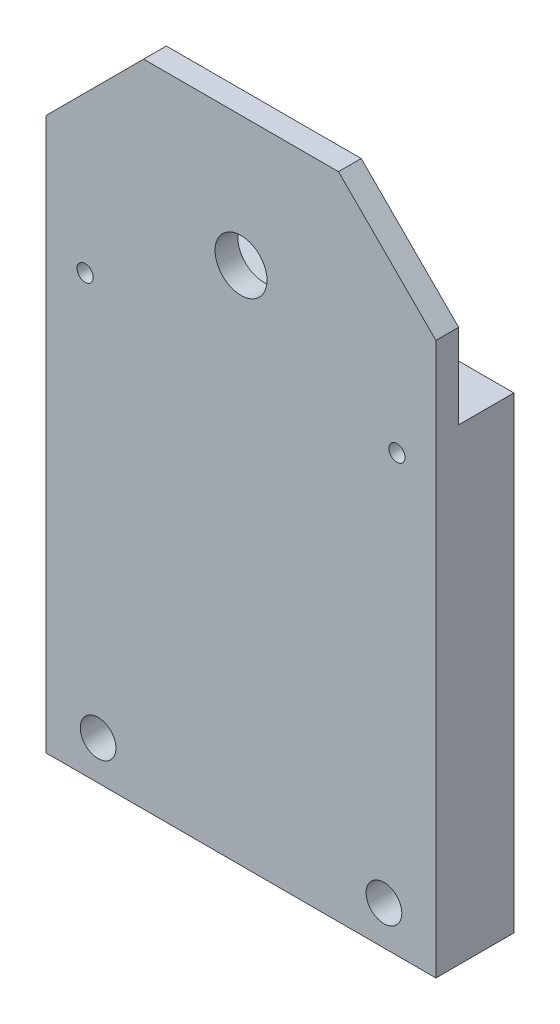
ISO-10303-21;
HEADER;
FILE_DESCRIPTION(('STEP AP214'),'2;1');
FILE_NAME('part.step','',(''),(''),'','','');
FILE_SCHEMA(('AUTOMOTIVE_DESIGN { 1 0 10303 214 1 1 1 1 }'));
ENDSEC;
DATA;
#1=APPLICATION_CONTEXT('core data for automotive mechanical design processes');
#2=APPLICATION_PROTOCOL_DEFINITION('international standard','automotive_design',2000,#1);
#3=PRODUCT_CONTEXT('',#1,'mechanical');
#4=PRODUCT('Part','Part','',(#3));
#5=PRODUCT_RELATED_PRODUCT_CATEGORY('part','',(#4));
#6=PRODUCT_DEFINITION_FORMATION('','',#4);
#7=PRODUCT_DEFINITION_CONTEXT('part definition',#1,'design');
#8=PRODUCT_DEFINITION('design','',#6,#7);
#9=PRODUCT_DEFINITION_SHAPE('','',#8);
#10=(LENGTH_UNIT() NAMED_UNIT(*) SI_UNIT(.MILLI.,.METRE.));
#11=(NAMED_UNIT(*) PLANE_ANGLE_UNIT() SI_UNIT($,.RADIAN.));
#12=(NAMED_UNIT(*) SI_UNIT($,.STERADIAN.) SOLID_ANGLE_UNIT());
#13=UNCERTAINTY_MEASURE_WITH_UNIT(LENGTH_MEASURE(1.E-05),#10,'distance_accuracy_value','');
#14=(GEOMETRIC_REPRESENTATION_CONTEXT(3) GLOBAL_UNCERTAINTY_ASSIGNED_CONTEXT((#13)) GLOBAL_UNIT_ASSIGNED_CONTEXT((#10,
#11,#12)) REPRESENTATION_CONTEXT('',''));
#15=CARTESIAN_POINT('',(0.,0.,0.));
#16=DIRECTION('',(0.,0.,1.));
#17=DIRECTION('',(1.,0.,0.));
#18=AXIS2_PLACEMENT_3D('',#15,#16,#17);
#19=CARTESIAN_POINT('',(0.,0.,12.));
#20=DIRECTION('',(1.,0.,0.));
#21=DIRECTION('',(0.,0.,-1.));
#22=AXIS2_PLACEMENT_3D('',#19,#20,#21);
#23=PLANE('',#22);
#24=DIRECTION('',(0.,-1.,0.));
#25=VECTOR('',#24,1.);
#26=CARTESIAN_POINT('',(0.,0.,12.));
#27=LINE('',#26,#25);
#28=CARTESIAN_POINT('',(0.,85.,12.));
#29=VERTEX_POINT('',#28);
#30=CARTESIAN_POINT('',(0.,0.,12.));
#31=VERTEX_POINT('',#30);
#32=EDGE_CURVE('E142',#29,#31,#27,.T.);
#33=ORIENTED_EDGE('',*,*,#32,.F.);
#34=DIRECTION('',(0.,0.,-1.));
#35=VECTOR('',#34,1.);
#36=CARTESIAN_POINT('',(0.,85.,12.));
#37=LINE('',#36,#35);
#38=CARTESIAN_POINT('',(0.,85.,8.50000000000001));
#39=VERTEX_POINT('',#38);
#40=EDGE_CURVE('E159',#29,#39,#37,.T.);
#41=ORIENTED_EDGE('',*,*,#40,.T.);
#42=DIRECTION('',(0.,1.,0.));
#43=VECTOR('',#42,1.);
#44=CARTESIAN_POINT('',(0.,100.,8.5));
#45=LINE('',#44,#43);
#46=CARTESIAN_POINT('',(0.,72.,8.50000000000001));
#47=VERTEX_POINT('',#46);
#48=EDGE_CURVE('E125',#47,#39,#45,.T.);
#49=ORIENTED_EDGE('',*,*,#48,.F.);
#50=DIRECTION('',(0.,0.,1.));
#51=VECTOR('',#50,1.);
#52=CARTESIAN_POINT('',(0.,72.,0.));
#53=LINE('',#52,#51);
#54=CARTESIAN_POINT('',(0.,72.,0.));
#55=VERTEX_POINT('',#54);
#56=EDGE_CURVE('E107',#55,#47,#53,.T.);
#57=ORIENTED_EDGE('',*,*,#56,.F.);
#58=DIRECTION('',(0.,-1.,0.));
#59=VECTOR('',#58,1.);
#60=CARTESIAN_POINT('',(0.,0.,0.));
#61=LINE('',#60,#59);
#62=CARTESIAN_POINT('',(0.,0.,0.));
#63=VERTEX_POINT('',#62);
#64=EDGE_CURVE('E141',#55,#63,#61,.T.);
#65=ORIENTED_EDGE('',*,*,#64,.T.);
#66=DIRECTION('',(0.,0.,-1.));
#67=VECTOR('',#66,1.);
#68=CARTESIAN_POINT('',(0.,0.,12.));
#69=LINE('',#68,#67);
#70=EDGE_CURVE('E156',#31,#63,#69,.T.);
#71=ORIENTED_EDGE('',*,*,#70,.F.);
#72=EDGE_LOOP('',(#33,#41,#49,#57,#65,#71));
#73=FACE_BOUND('',#72,.T.);
#74=ADVANCED_FACE('F34',(#73),#23,.F.);
#75=CARTESIAN_POINT('',(0.,0.,12.));
#76=DIRECTION('',(0.,1.,0.));
#77=DIRECTION('',(0.,0.,1.));
#78=AXIS2_PLACEMENT_3D('',#75,#76,#77);
#79=PLANE('',#78);
#80=DIRECTION('',(1.,0.,0.));
#81=VECTOR('',#80,1.);
#82=CARTESIAN_POINT('',(0.,0.,0.));
#83=LINE('',#82,#81);
#84=CARTESIAN_POINT('',(60.,0.,0.));
#85=VERTEX_POINT('',#84);
#86=EDGE_CURVE('E152',#63,#85,#83,.T.);
#87=ORIENTED_EDGE('',*,*,#86,.T.);
#88=DIRECTION('',(0.,0.,-1.));
#89=VECTOR('',#88,1.);
#90=CARTESIAN_POINT('',(60.,0.,12.));
#91=LINE('',#90,#89);
#92=CARTESIAN_POINT('',(60.,0.,12.));
#93=VERTEX_POINT('',#92);
#94=EDGE_CURVE('E150',#93,#85,#91,.T.);
#95=ORIENTED_EDGE('',*,*,#94,.F.);
#96=DIRECTION('',(1.,0.,0.));
#97=VECTOR('',#96,1.);
#98=CARTESIAN_POINT('',(0.,0.,12.));
#99=LINE('',#98,#97);
#100=EDGE_CURVE('E144',#31,#93,#99,.T.);
#101=ORIENTED_EDGE('',*,*,#100,.F.);
#102=ORIENTED_EDGE('',*,*,#70,.T.);
#103=EDGE_LOOP('',(#87,#95,#101,#102));
#104=FACE_BOUND('',#103,.T.);
#105=ADVANCED_FACE('F190',(#104),#79,.F.);
#106=CARTESIAN_POINT('',(60.,0.,12.));
#107=DIRECTION('',(-1.,0.,0.));
#108=DIRECTION('',(0.,0.,1.));
#109=AXIS2_PLACEMENT_3D('',#106,#107,#108);
#110=PLANE('',#109);
#111=DIRECTION('',(0.,1.,0.));
#112=VECTOR('',#111,1.);
#113=CARTESIAN_POINT('',(60.,100.,8.5));
#114=LINE('',#113,#112);
#115=CARTESIAN_POINT('',(60.,72.,8.50000000000001));
#116=VERTEX_POINT('',#115);
#117=CARTESIAN_POINT('',(60.,84.9999999999999,8.50000000000001));
#118=VERTEX_POINT('',#117);
#119=EDGE_CURVE('E114',#116,#118,#114,.T.);
#120=ORIENTED_EDGE('',*,*,#119,.T.);
#121=DIRECTION('',(0.,0.,1.));
#122=VECTOR('',#121,1.);
#123=CARTESIAN_POINT('',(60.,84.9999999999999,12.));
#124=LINE('',#123,#122);
#125=CARTESIAN_POINT('',(60.,84.9999999999999,12.));
#126=VERTEX_POINT('',#125);
#127=EDGE_CURVE('E11',#118,#126,#124,.T.);
#128=ORIENTED_EDGE('',*,*,#127,.T.);
#129=DIRECTION('',(0.,1.,0.));
#130=VECTOR('',#129,1.);
#131=CARTESIAN_POINT('',(60.,0.,12.));
#132=LINE('',#131,#130);
#133=EDGE_CURVE('E146',#93,#126,#132,.T.);
#134=ORIENTED_EDGE('',*,*,#133,.F.);
#135=ORIENTED_EDGE('',*,*,#94,.T.);
#136=DIRECTION('',(0.,1.,0.));
#137=VECTOR('',#136,1.);
#138=CARTESIAN_POINT('',(60.,0.,0.));
#139=LINE('',#138,#137);
#140=CARTESIAN_POINT('',(60.,72.,0.));
#141=VERTEX_POINT('',#140);
#142=EDGE_CURVE('E124',#85,#141,#139,.T.);
#143=ORIENTED_EDGE('',*,*,#142,.T.);
#144=DIRECTION('',(0.,0.,1.));
#145=VECTOR('',#144,1.);
#146=CARTESIAN_POINT('',(60.,72.,0.));
#147=LINE('',#146,#145);
#148=EDGE_CURVE('E104',#141,#116,#147,.T.);
#149=ORIENTED_EDGE('',*,*,#148,.T.);
#150=EDGE_LOOP('',(#120,#128,#134,#135,#143,#149));
#151=FACE_BOUND('',#150,.T.);
#152=ADVANCED_FACE('F121',(#151),#110,.F.);
#153=CARTESIAN_POINT('',(0.,100.,12.));
#154=DIRECTION('',(0.,-1.,0.));
#155=DIRECTION('',(0.,0.,-1.));
#156=AXIS2_PLACEMENT_3D('',#153,#154,#155);
#157=PLANE('',#156);
#158=DIRECTION('',(-1.,0.,0.));
#159=VECTOR('',#158,1.);
#160=CARTESIAN_POINT('',(60.,100.,8.5));
#161=LINE('',#160,#159);
#162=CARTESIAN_POINT('',(45.,100.,8.5));
#163=VERTEX_POINT('',#162);
#164=CARTESIAN_POINT('',(15.0000000000001,100.,8.5));
#165=VERTEX_POINT('',#164);
#166=EDGE_CURVE('E111',#163,#165,#161,.T.);
#167=ORIENTED_EDGE('',*,*,#166,.T.);
#168=DIRECTION('',(0.,0.,1.));
#169=VECTOR('',#168,1.);
#170=CARTESIAN_POINT('',(15.0000000000001,100.,12.));
#171=LINE('',#170,#169);
#172=CARTESIAN_POINT('',(15.0000000000001,100.,12.));
#173=VERTEX_POINT('',#172);
#174=EDGE_CURVE('E55',#165,#173,#171,.T.);
#175=ORIENTED_EDGE('',*,*,#174,.T.);
#176=DIRECTION('',(-1.,0.,0.));
#177=VECTOR('',#176,1.);
#178=CARTESIAN_POINT('',(0.,100.,12.));
#179=LINE('',#178,#177);
#180=CARTESIAN_POINT('',(45.,100.,12.));
#181=VERTEX_POINT('',#180);
#182=EDGE_CURVE('E148',#181,#173,#179,.T.);
#183=ORIENTED_EDGE('',*,*,#182,.F.);
#184=DIRECTION('',(0.,0.,-1.));
#185=VECTOR('',#184,1.);
#186=CARTESIAN_POINT('',(45.,100.,12.));
#187=LINE('',#186,#185);
#188=EDGE_CURVE('E165',#181,#163,#187,.T.);
#189=ORIENTED_EDGE('',*,*,#188,.T.);
#190=EDGE_LOOP('',(#167,#175,#183,#189));
#191=FACE_BOUND('',#190,.T.);
#192=ADVANCED_FACE('F180',(#191),#157,.F.);
#193=CARTESIAN_POINT('',(0.,100.,12.));
#194=DIRECTION('',(0.,0.,-1.));
#195=DIRECTION('',(-1.,0.,0.));
#196=AXIS2_PLACEMENT_3D('',#193,#194,#195);
#197=PLANE('',#196);
#198=CARTESIAN_POINT('',(52.,6.,12.));
#199=DIRECTION('',(0.,0.,-1.));
#200=DIRECTION('',(-1.,0.,0.));
#201=AXIS2_PLACEMENT_3D('',#198,#199,#200);
#202=CIRCLE('',#201,2.75);
#203=CARTESIAN_POINT('',(49.25,6.,12.));
#204=VERTEX_POINT('',#203);
#205=EDGE_CURVE('E396',#204,#204,#202,.T.);
#206=ORIENTED_EDGE('',*,*,#205,.T.);
#207=EDGE_LOOP('',(#206));
#208=FACE_BOUND('',#207,.T.);
#209=CARTESIAN_POINT('',(8.,6.,12.));
#210=DIRECTION('',(0.,0.,-1.));
#211=DIRECTION('',(-1.,0.,0.));
#212=AXIS2_PLACEMENT_3D('',#209,#210,#211);
#213=CIRCLE('',#212,2.75);
#214=CARTESIAN_POINT('',(5.25,6.,12.));
#215=VERTEX_POINT('',#214);
#216=EDGE_CURVE('E386',#215,#215,#213,.T.);
#217=ORIENTED_EDGE('',*,*,#216,.T.);
#218=EDGE_LOOP('',(#217));
#219=FACE_BOUND('',#218,.T.);
#220=CARTESIAN_POINT('',(6.00000000000001,67.,12.));
#221=DIRECTION('',(0.,0.,1.));
#222=DIRECTION('',(1.,0.,0.));
#223=AXIS2_PLACEMENT_3D('',#220,#221,#222);
#224=CIRCLE('',#223,1.24999999999999);
#225=CARTESIAN_POINT('',(7.24999999999999,67.,12.));
#226=VERTEX_POINT('',#225);
#227=EDGE_CURVE('E381',#226,#226,#224,.T.);
#228=ORIENTED_EDGE('',*,*,#227,.F.);
#229=EDGE_LOOP('',(#228));
#230=FACE_BOUND('',#229,.T.);
#231=CARTESIAN_POINT('',(54.,67.,12.));
#232=DIRECTION('',(0.,0.,1.));
#233=DIRECTION('',(1.,0.,0.));
#234=AXIS2_PLACEMENT_3D('',#231,#232,#233);
#235=CIRCLE('',#234,1.24999999999999);
#236=CARTESIAN_POINT('',(55.25,67.,12.));
#237=VERTEX_POINT('',#236);
#238=EDGE_CURVE('E377',#237,#237,#235,.T.);
#239=ORIENTED_EDGE('',*,*,#238,.F.);
#240=EDGE_LOOP('',(#239));
#241=FACE_BOUND('',#240,.T.);
#242=CARTESIAN_POINT('',(30.,80.,12.));
#243=DIRECTION('',(0.,0.,1.));
#244=DIRECTION('',(1.,0.,0.));
#245=AXIS2_PLACEMENT_3D('',#242,#243,#244);
#246=CIRCLE('',#245,4.);
#247=CARTESIAN_POINT('',(34.,80.,12.));
#248=VERTEX_POINT('',#247);
#249=EDGE_CURVE('E138',#248,#248,#246,.T.);
#250=ORIENTED_EDGE('',*,*,#249,.F.);
#251=EDGE_LOOP('',(#250));
#252=FACE_BOUND('',#251,.T.);
#253=ORIENTED_EDGE('',*,*,#182,.T.);
#254=DIRECTION('',(0.707106781186549,0.707106781186547,0.));
#255=VECTOR('',#254,1.);
#256=CARTESIAN_POINT('',(0.,85.,12.));
#257=LINE('',#256,#255);
#258=EDGE_CURVE('E42',#173,#29,#257,.F.);
#259=ORIENTED_EDGE('',*,*,#258,.T.);
#260=ORIENTED_EDGE('',*,*,#32,.T.);
#261=ORIENTED_EDGE('',*,*,#100,.T.);
#262=ORIENTED_EDGE('',*,*,#133,.T.);
#263=DIRECTION('',(0.707106781186546,-0.707106781186549,0.));
#264=VECTOR('',#263,1.);
#265=CARTESIAN_POINT('',(45.,100.,12.));
#266=LINE('',#265,#264);
#267=EDGE_CURVE('E169',#126,#181,#266,.F.);
#268=ORIENTED_EDGE('',*,*,#267,.T.);
#269=EDGE_LOOP('',(#253,#259,#260,#261,#262,#268));
#270=FACE_BOUND('',#269,.T.);
#271=ADVANCED_FACE('F173',(#208,#219,#230,#241,#252,#270),#197,.F.);
#272=CARTESIAN_POINT('',(0.,100.,0.));
#273=DIRECTION('',(0.,0.,-1.));
#274=DIRECTION('',(-1.,0.,0.));
#275=AXIS2_PLACEMENT_3D('',#272,#273,#274);
#276=PLANE('',#275);
#277=CARTESIAN_POINT('',(52.,6.,0.));
#278=DIRECTION('',(0.,0.,-1.));
#279=DIRECTION('',(-1.,0.,0.));
#280=AXIS2_PLACEMENT_3D('',#277,#278,#279);
#281=CIRCLE('',#280,5.);
#282=CARTESIAN_POINT('',(47.,6.,0.));
#283=VERTEX_POINT('',#282);
#284=EDGE_CURVE('E366',#283,#283,#281,.T.);
#285=ORIENTED_EDGE('',*,*,#284,.F.);
#286=EDGE_LOOP('',(#285));
#287=FACE_BOUND('',#286,.T.);
#288=CARTESIAN_POINT('',(8.,6.,0.));
#289=DIRECTION('',(0.,0.,-1.));
#290=DIRECTION('',(-1.,0.,0.));
#291=AXIS2_PLACEMENT_3D('',#288,#289,#290);
#292=CIRCLE('',#291,5.);
#293=CARTESIAN_POINT('',(3.,6.,0.));
#294=VERTEX_POINT('',#293);
#295=EDGE_CURVE('E370',#294,#294,#292,.T.);
#296=ORIENTED_EDGE('',*,*,#295,.F.);
#297=EDGE_LOOP('',(#296));
#298=FACE_BOUND('',#297,.T.);
#299=CARTESIAN_POINT('',(6.00000000000001,67.,-9.0205620750794E-13));
#300=DIRECTION('',(0.,0.,1.));
#301=DIRECTION('',(1.,0.,0.));
#302=AXIS2_PLACEMENT_3D('',#299,#300,#301);
#303=CIRCLE('',#302,1.25);
#304=CARTESIAN_POINT('',(7.25,67.,-9.0205620750794E-13));
#305=VERTEX_POINT('',#304);
#306=EDGE_CURVE('E374',#305,#305,#303,.T.);
#307=ORIENTED_EDGE('',*,*,#306,.T.);
#308=EDGE_LOOP('',(#307));
#309=FACE_BOUND('',#308,.T.);
#310=CARTESIAN_POINT('',(54.,67.,-4.5102810375397E-13));
#311=DIRECTION('',(0.,0.,1.));
#312=DIRECTION('',(1.,0.,0.));
#313=AXIS2_PLACEMENT_3D('',#310,#311,#312);
#314=CIRCLE('',#313,1.24999999999999);
#315=CARTESIAN_POINT('',(55.25,67.,-4.5102810375397E-13));
#316=VERTEX_POINT('',#315);
#317=EDGE_CURVE('E129',#316,#316,#314,.T.);
#318=ORIENTED_EDGE('',*,*,#317,.T.);
#319=EDGE_LOOP('',(#318));
#320=FACE_BOUND('',#319,.T.);
#321=DIRECTION('',(-1.,0.,0.));
#322=VECTOR('',#321,1.);
#323=CARTESIAN_POINT('',(60.,72.,0.));
#324=LINE('',#323,#322);
#325=EDGE_CURVE('E112',#141,#55,#324,.T.);
#326=ORIENTED_EDGE('',*,*,#325,.F.);
#327=ORIENTED_EDGE('',*,*,#142,.F.);
#328=ORIENTED_EDGE('',*,*,#86,.F.);
#329=ORIENTED_EDGE('',*,*,#64,.F.);
#330=EDGE_LOOP('',(#326,#327,#328,#329));
#331=FACE_BOUND('',#330,.T.);
#332=ADVANCED_FACE('F188',(#287,#298,#309,#320,#331),#276,.T.);
#333=CARTESIAN_POINT('',(30.,80.,8.5));
#334=DIRECTION('',(0.,0.,1.));
#335=DIRECTION('',(1.,0.,0.));
#336=AXIS2_PLACEMENT_3D('',#333,#334,#335);
#337=CYLINDRICAL_SURFACE('',#336,4.);
#338=CARTESIAN_POINT('',(30.,80.,8.50000000000001));
#339=DIRECTION('',(0.,0.,1.));
#340=DIRECTION('',(0.,-1.,0.));
#341=AXIS2_PLACEMENT_3D('',#338,#339,#340);
#342=CIRCLE('',#341,4.);
#343=CARTESIAN_POINT('',(30.,76.,8.50000000000001));
#344=VERTEX_POINT('',#343);
#345=EDGE_CURVE('E133',#344,#344,#342,.F.);
#346=ORIENTED_EDGE('',*,*,#345,.T.);
#347=EDGE_LOOP('',(#346));
#348=FACE_BOUND('',#347,.T.);
#349=ORIENTED_EDGE('',*,*,#249,.T.);
#350=EDGE_LOOP('',(#349));
#351=FACE_BOUND('',#350,.T.);
#352=ADVANCED_FACE('F243',(#348,#351),#337,.F.);
#353=CARTESIAN_POINT('',(60.,100.,8.5));
#354=DIRECTION('',(0.,0.,1.));
#355=DIRECTION('',(0.,-1.,0.));
#356=AXIS2_PLACEMENT_3D('',#353,#354,#355);
#357=PLANE('',#356);
#358=ORIENTED_EDGE('',*,*,#48,.T.);
#359=DIRECTION('',(-0.707106781186548,-0.707106781186546,0.));
#360=VECTOR('',#359,1.);
#361=CARTESIAN_POINT('',(0.,85.,8.50000000000001));
#362=LINE('',#361,#360);
#363=EDGE_CURVE('E163',#39,#165,#362,.F.);
#364=ORIENTED_EDGE('',*,*,#363,.T.);
#365=ORIENTED_EDGE('',*,*,#166,.F.);
#366=DIRECTION('',(-0.707106781186546,0.707106781186549,0.));
#367=VECTOR('',#366,1.);
#368=CARTESIAN_POINT('',(45.,100.,8.5));
#369=LINE('',#368,#367);
#370=EDGE_CURVE('E118',#163,#118,#369,.F.);
#371=ORIENTED_EDGE('',*,*,#370,.T.);
#372=ORIENTED_EDGE('',*,*,#119,.F.);
#373=DIRECTION('',(-1.,0.,0.));
#374=VECTOR('',#373,1.);
#375=CARTESIAN_POINT('',(60.,72.,8.50000000000001));
#376=LINE('',#375,#374);
#377=EDGE_CURVE('E100',#116,#47,#376,.T.);
#378=ORIENTED_EDGE('',*,*,#377,.T.);
#379=EDGE_LOOP('',(#358,#364,#365,#371,#372,#378));
#380=FACE_BOUND('',#379,.T.);
#381=ORIENTED_EDGE('',*,*,#345,.F.);
#382=EDGE_LOOP('',(#381));
#383=FACE_BOUND('',#382,.T.);
#384=ADVANCED_FACE('F115',(#380,#383),#357,.F.);
#385=CARTESIAN_POINT('',(60.,72.,0.));
#386=DIRECTION('',(0.,-1.,0.));
#387=DIRECTION('',(0.,0.,-1.));
#388=AXIS2_PLACEMENT_3D('',#385,#386,#387);
#389=PLANE('',#388);
#390=ORIENTED_EDGE('',*,*,#56,.T.);
#391=ORIENTED_EDGE('',*,*,#377,.F.);
#392=ORIENTED_EDGE('',*,*,#148,.F.);
#393=ORIENTED_EDGE('',*,*,#325,.T.);
#394=EDGE_LOOP('',(#390,#391,#392,#393));
#395=FACE_BOUND('',#394,.T.);
#396=ADVANCED_FACE('F102',(#395),#389,.F.);
#397=CARTESIAN_POINT('',(54.,67.,12.));
#398=DIRECTION('',(0.,0.,1.));
#399=DIRECTION('',(1.,0.,0.));
#400=AXIS2_PLACEMENT_3D('',#397,#398,#399);
#401=CYLINDRICAL_SURFACE('',#400,1.24999999999999);
#402=ORIENTED_EDGE('',*,*,#317,.F.);
#403=EDGE_LOOP('',(#402));
#404=FACE_BOUND('',#403,.T.);
#405=ORIENTED_EDGE('',*,*,#238,.T.);
#406=EDGE_LOOP('',(#405));
#407=FACE_BOUND('',#406,.T.);
#408=ADVANCED_FACE('F236',(#404,#407),#401,.F.);
#409=CARTESIAN_POINT('',(6.00000000000001,67.,12.));
#410=DIRECTION('',(0.,0.,1.));
#411=DIRECTION('',(1.,0.,0.));
#412=AXIS2_PLACEMENT_3D('',#409,#410,#411);
#413=CYLINDRICAL_SURFACE('',#412,1.24999999999999);
#414=ORIENTED_EDGE('',*,*,#306,.F.);
#415=EDGE_LOOP('',(#414));
#416=FACE_BOUND('',#415,.T.);
#417=ORIENTED_EDGE('',*,*,#227,.T.);
#418=EDGE_LOOP('',(#417));
#419=FACE_BOUND('',#418,.T.);
#420=ADVANCED_FACE('F232',(#416,#419),#413,.F.);
#421=CARTESIAN_POINT('',(8.,6.,0.));
#422=DIRECTION('',(0.,0.,-1.));
#423=DIRECTION('',(-1.,0.,0.));
#424=AXIS2_PLACEMENT_3D('',#421,#422,#423);
#425=CYLINDRICAL_SURFACE('',#424,2.75);
#426=ORIENTED_EDGE('',*,*,#216,.F.);
#427=EDGE_LOOP('',(#426));
#428=FACE_BOUND('',#427,.T.);
#429=CARTESIAN_POINT('',(8.,6.,5.));
#430=DIRECTION('',(0.,0.,-1.));
#431=DIRECTION('',(-1.,0.,0.));
#432=AXIS2_PLACEMENT_3D('',#429,#430,#431);
#433=CIRCLE('',#432,2.75);
#434=CARTESIAN_POINT('',(5.25,6.,5.));
#435=VERTEX_POINT('',#434);
#436=EDGE_CURVE('E389',#435,#435,#433,.T.);
#437=ORIENTED_EDGE('',*,*,#436,.T.);
#438=EDGE_LOOP('',(#437));
#439=FACE_BOUND('',#438,.T.);
#440=ADVANCED_FACE('F228',(#428,#439),#425,.F.);
#441=CARTESIAN_POINT('',(10.75,6.,5.));
#442=DIRECTION('',(0.,0.,1.));
#443=DIRECTION('',(1.,0.,0.));
#444=AXIS2_PLACEMENT_3D('',#441,#442,#443);
#445=PLANE('',#444);
#446=ORIENTED_EDGE('',*,*,#436,.F.);
#447=EDGE_LOOP('',(#446));
#448=FACE_BOUND('',#447,.T.);
#449=CARTESIAN_POINT('',(8.,6.,5.));
#450=DIRECTION('',(0.,0.,-1.));
#451=DIRECTION('',(-1.,0.,0.));
#452=AXIS2_PLACEMENT_3D('',#449,#450,#451);
#453=CIRCLE('',#452,5.);
#454=CARTESIAN_POINT('',(3.,6.,5.));
#455=VERTEX_POINT('',#454);
#456=EDGE_CURVE('E392',#455,#455,#453,.T.);
#457=ORIENTED_EDGE('',*,*,#456,.T.);
#458=EDGE_LOOP('',(#457));
#459=FACE_BOUND('',#458,.T.);
#460=ADVANCED_FACE('F224',(#448,#459),#445,.F.);
#461=CARTESIAN_POINT('',(8.,6.,0.));
#462=DIRECTION('',(0.,0.,-1.));
#463=DIRECTION('',(-1.,0.,0.));
#464=AXIS2_PLACEMENT_3D('',#461,#462,#463);
#465=CYLINDRICAL_SURFACE('',#464,5.);
#466=ORIENTED_EDGE('',*,*,#456,.F.);
#467=EDGE_LOOP('',(#466));
#468=FACE_BOUND('',#467,.T.);
#469=ORIENTED_EDGE('',*,*,#295,.T.);
#470=EDGE_LOOP('',(#469));
#471=FACE_BOUND('',#470,.T.);
#472=ADVANCED_FACE('F220',(#468,#471),#465,.F.);
#473=CARTESIAN_POINT('',(52.,6.,0.));
#474=DIRECTION('',(0.,0.,-1.));
#475=DIRECTION('',(-1.,0.,0.));
#476=AXIS2_PLACEMENT_3D('',#473,#474,#475);
#477=CYLINDRICAL_SURFACE('',#476,2.75);
#478=ORIENTED_EDGE('',*,*,#205,.F.);
#479=EDGE_LOOP('',(#478));
#480=FACE_BOUND('',#479,.T.);
#481=CARTESIAN_POINT('',(52.,6.,5.));
#482=DIRECTION('',(0.,0.,-1.));
#483=DIRECTION('',(-1.,0.,0.));
#484=AXIS2_PLACEMENT_3D('',#481,#482,#483);
#485=CIRCLE('',#484,2.75);
#486=CARTESIAN_POINT('',(49.25,6.,5.));
#487=VERTEX_POINT('',#486);
#488=EDGE_CURVE('E399',#487,#487,#485,.T.);
#489=ORIENTED_EDGE('',*,*,#488,.T.);
#490=EDGE_LOOP('',(#489));
#491=FACE_BOUND('',#490,.T.);
#492=ADVANCED_FACE('F212',(#480,#491),#477,.F.);
#493=CARTESIAN_POINT('',(54.75,6.,5.));
#494=DIRECTION('',(0.,0.,1.));
#495=DIRECTION('',(1.,0.,0.));
#496=AXIS2_PLACEMENT_3D('',#493,#494,#495);
#497=PLANE('',#496);
#498=ORIENTED_EDGE('',*,*,#488,.F.);
#499=EDGE_LOOP('',(#498));
#500=FACE_BOUND('',#499,.T.);
#501=CARTESIAN_POINT('',(52.,6.,5.));
#502=DIRECTION('',(0.,0.,-1.));
#503=DIRECTION('',(-1.,0.,0.));
#504=AXIS2_PLACEMENT_3D('',#501,#502,#503);
#505=CIRCLE('',#504,5.);
#506=CARTESIAN_POINT('',(47.,6.,5.));
#507=VERTEX_POINT('',#506);
#508=EDGE_CURVE('E402',#507,#507,#505,.T.);
#509=ORIENTED_EDGE('',*,*,#508,.T.);
#510=EDGE_LOOP('',(#509));
#511=FACE_BOUND('',#510,.T.);
#512=ADVANCED_FACE('F206',(#500,#511),#497,.F.);
#513=CARTESIAN_POINT('',(52.,6.,0.));
#514=DIRECTION('',(0.,0.,-1.));
#515=DIRECTION('',(-1.,0.,0.));
#516=AXIS2_PLACEMENT_3D('',#513,#514,#515);
#517=CYLINDRICAL_SURFACE('',#516,5.);
#518=ORIENTED_EDGE('',*,*,#508,.F.);
#519=EDGE_LOOP('',(#518));
#520=FACE_BOUND('',#519,.T.);
#521=ORIENTED_EDGE('',*,*,#284,.T.);
#522=EDGE_LOOP('',(#521));
#523=FACE_BOUND('',#522,.T.);
#524=ADVANCED_FACE('F201',(#520,#523),#517,.F.);
#525=CARTESIAN_POINT('',(0.,85.,12.));
#526=DIRECTION('',(0.707106781186546,-0.707106781186548,0.));
#527=DIRECTION('',(0.707106781186549,0.707106781186547,0.));
#528=AXIS2_PLACEMENT_3D('',#525,#526,#527);
#529=PLANE('',#528);
#530=ORIENTED_EDGE('',*,*,#258,.F.);
#531=ORIENTED_EDGE('',*,*,#174,.F.);
#532=ORIENTED_EDGE('',*,*,#363,.F.);
#533=ORIENTED_EDGE('',*,*,#40,.F.);
#534=EDGE_LOOP('',(#530,#531,#532,#533));
#535=FACE_BOUND('',#534,.T.);
#536=ADVANCED_FACE('F179',(#535),#529,.F.);
#537=CARTESIAN_POINT('',(45.,100.,12.));
#538=DIRECTION('',(-0.707106781186549,-0.707106781186546,0.));
#539=DIRECTION('',(0.707106781186546,-0.707106781186549,0.));
#540=AXIS2_PLACEMENT_3D('',#537,#538,#539);
#541=PLANE('',#540);
#542=ORIENTED_EDGE('',*,*,#267,.F.);
#543=ORIENTED_EDGE('',*,*,#127,.F.);
#544=ORIENTED_EDGE('',*,*,#370,.F.);
#545=ORIENTED_EDGE('',*,*,#188,.F.);
#546=EDGE_LOOP('',(#542,#543,#544,#545));
#547=FACE_BOUND('',#546,.T.);
#548=ADVANCED_FACE('F36',(#547),#541,.F.);
#549=CLOSED_SHELL('',(#74,#105,#152,#192,#271,#332,#352,#384,#396,#408,#420,#440,#460,#472,#492,
#512,#524,#536,#548));
#550=MANIFOLD_SOLID_BREP('B2',#549);
#551=ADVANCED_BREP_SHAPE_REPRESENTATION('',(#18,#550),#14);
#552=SHAPE_DEFINITION_REPRESENTATION(#9,#551);
ENDSEC;
END-ISO-10303-21;
